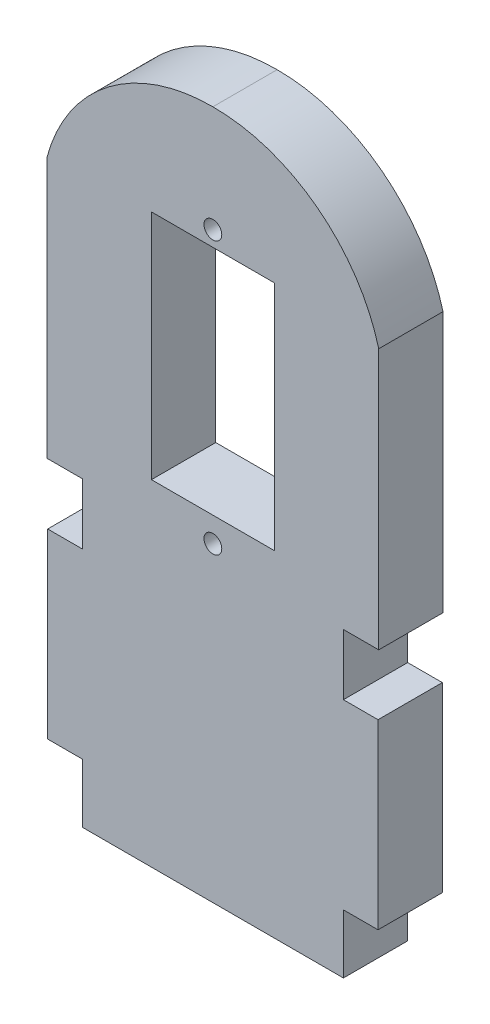
ISO-10303-21;
HEADER;
FILE_DESCRIPTION(('STEP AP214'),'2;1');
FILE_NAME('part.step','',(''),(''),'','','');
FILE_SCHEMA(('AUTOMOTIVE_DESIGN { 1 0 10303 214 1 1 1 1 }'));
ENDSEC;
DATA;
#1=APPLICATION_CONTEXT('core data for automotive mechanical design processes');
#2=APPLICATION_PROTOCOL_DEFINITION('international standard','automotive_design',2000,#1);
#3=PRODUCT_CONTEXT('',#1,'mechanical');
#4=PRODUCT('Part','Part','',(#3));
#5=PRODUCT_RELATED_PRODUCT_CATEGORY('part','',(#4));
#6=PRODUCT_DEFINITION_FORMATION('','',#4);
#7=PRODUCT_DEFINITION_CONTEXT('part definition',#1,'design');
#8=PRODUCT_DEFINITION('design','',#6,#7);
#9=PRODUCT_DEFINITION_SHAPE('','',#8);
#10=(LENGTH_UNIT() NAMED_UNIT(*) SI_UNIT(.MILLI.,.METRE.));
#11=(NAMED_UNIT(*) PLANE_ANGLE_UNIT() SI_UNIT($,.RADIAN.));
#12=(NAMED_UNIT(*) SI_UNIT($,.STERADIAN.) SOLID_ANGLE_UNIT());
#13=UNCERTAINTY_MEASURE_WITH_UNIT(LENGTH_MEASURE(1.E-05),#10,'distance_accuracy_value','');
#14=(GEOMETRIC_REPRESENTATION_CONTEXT(3) GLOBAL_UNCERTAINTY_ASSIGNED_CONTEXT((#13)) GLOBAL_UNIT_ASSIGNED_CONTEXT((#10,
#11,#12)) REPRESENTATION_CONTEXT('',''));
#15=CARTESIAN_POINT('',(0.,0.,0.));
#16=DIRECTION('',(0.,0.,1.));
#17=DIRECTION('',(1.,0.,0.));
#18=AXIS2_PLACEMENT_3D('',#15,#16,#17);
#19=CARTESIAN_POINT('',(48.9892867650321,0.,6.5));
#20=DIRECTION('',(1.,0.,0.));
#21=DIRECTION('',(0.,1.,0.));
#22=AXIS2_PLACEMENT_3D('',#19,#20,#21);
#23=PLANE('',#22);
#24=DIRECTION('',(0.,-1.,0.));
#25=VECTOR('',#24,1.);
#26=CARTESIAN_POINT('',(48.9892867650321,0.,0.));
#27=LINE('',#26,#25);
#28=CARTESIAN_POINT('',(48.9892867650321,76.6618321268697,0.));
#29=VERTEX_POINT('',#28);
#30=CARTESIAN_POINT('',(48.9892867650321,53.2123013687647,0.));
#31=VERTEX_POINT('',#30);
#32=EDGE_CURVE('E286',#29,#31,#27,.T.);
#33=ORIENTED_EDGE('',*,*,#32,.T.);
#34=DIRECTION('',(0.,0.,-1.));
#35=VECTOR('',#34,1.);
#36=CARTESIAN_POINT('',(48.9892867650321,53.2123013687647,6.5));
#37=LINE('',#36,#35);
#38=CARTESIAN_POINT('',(48.9892867650321,53.2123013687647,6.5));
#39=VERTEX_POINT('',#38);
#40=EDGE_CURVE('E11',#39,#31,#37,.T.);
#41=ORIENTED_EDGE('',*,*,#40,.F.);
#42=DIRECTION('',(0.,-1.,0.));
#43=VECTOR('',#42,1.);
#44=CARTESIAN_POINT('',(48.9892867650321,0.,6.5));
#45=LINE('',#44,#43);
#46=CARTESIAN_POINT('',(48.9892867650321,76.6618321268697,6.5));
#47=VERTEX_POINT('',#46);
#48=EDGE_CURVE('E197',#47,#39,#45,.T.);
#49=ORIENTED_EDGE('',*,*,#48,.F.);
#50=DIRECTION('',(0.,0.,-1.));
#51=VECTOR('',#50,1.);
#52=CARTESIAN_POINT('',(48.9892867650321,76.6618321268697,6.5));
#53=LINE('',#52,#51);
#54=EDGE_CURVE('E298',#47,#29,#53,.T.);
#55=ORIENTED_EDGE('',*,*,#54,.T.);
#56=EDGE_LOOP('',(#33,#41,#49,#55));
#57=FACE_BOUND('',#56,.T.);
#58=ADVANCED_FACE('F41',(#57),#23,.F.);
#59=CARTESIAN_POINT('',(0.,53.2123013687647,6.5));
#60=DIRECTION('',(0.,-1.,0.));
#61=DIRECTION('',(0.,0.,-1.));
#62=AXIS2_PLACEMENT_3D('',#59,#60,#61);
#63=PLANE('',#62);
#64=DIRECTION('',(-1.,0.,0.));
#65=VECTOR('',#64,1.);
#66=CARTESIAN_POINT('',(0.,53.2123013687647,0.));
#67=LINE('',#66,#65);
#68=CARTESIAN_POINT('',(36.5722867650322,53.2123013687647,0.));
#69=VERTEX_POINT('',#68);
#70=EDGE_CURVE('E204',#31,#69,#67,.T.);
#71=ORIENTED_EDGE('',*,*,#70,.T.);
#72=DIRECTION('',(0.,0.,-1.));
#73=VECTOR('',#72,1.);
#74=CARTESIAN_POINT('',(36.5722867650322,53.2123013687647,6.5));
#75=LINE('',#74,#73);
#76=CARTESIAN_POINT('',(36.5722867650322,53.2123013687647,6.5));
#77=VERTEX_POINT('',#76);
#78=EDGE_CURVE('E52',#77,#69,#75,.T.);
#79=ORIENTED_EDGE('',*,*,#78,.F.);
#80=DIRECTION('',(-1.,0.,0.));
#81=VECTOR('',#80,1.);
#82=CARTESIAN_POINT('',(0.,53.2123013687647,6.5));
#83=LINE('',#82,#81);
#84=EDGE_CURVE('E191',#39,#77,#83,.T.);
#85=ORIENTED_EDGE('',*,*,#84,.F.);
#86=ORIENTED_EDGE('',*,*,#40,.T.);
#87=EDGE_LOOP('',(#71,#79,#85,#86));
#88=FACE_BOUND('',#87,.T.);
#89=ADVANCED_FACE('F203',(#88),#63,.F.);
#90=CARTESIAN_POINT('',(36.5722867650322,0.,6.5));
#91=DIRECTION('',(1.,0.,0.));
#92=DIRECTION('',(0.,1.,0.));
#93=AXIS2_PLACEMENT_3D('',#90,#91,#92);
#94=PLANE('',#93);
#95=DIRECTION('',(0.,-1.,0.));
#96=VECTOR('',#95,1.);
#97=CARTESIAN_POINT('',(36.5722867650322,0.,0.));
#98=LINE('',#97,#96);
#99=CARTESIAN_POINT('',(36.5722867650322,76.6618321268697,0.));
#100=VERTEX_POINT('',#99);
#101=EDGE_CURVE('E292',#100,#69,#98,.T.);
#102=ORIENTED_EDGE('',*,*,#101,.F.);
#103=DIRECTION('',(0.,0.,-1.));
#104=VECTOR('',#103,1.);
#105=CARTESIAN_POINT('',(36.5722867650322,76.6618321268697,6.5));
#106=LINE('',#105,#104);
#107=CARTESIAN_POINT('',(36.5722867650322,76.6618321268697,6.5));
#108=VERTEX_POINT('',#107);
#109=EDGE_CURVE('E128',#108,#100,#106,.T.);
#110=ORIENTED_EDGE('',*,*,#109,.F.);
#111=DIRECTION('',(0.,-1.,0.));
#112=VECTOR('',#111,1.);
#113=CARTESIAN_POINT('',(36.5722867650322,0.,6.5));
#114=LINE('',#113,#112);
#115=EDGE_CURVE('E195',#108,#77,#114,.T.);
#116=ORIENTED_EDGE('',*,*,#115,.T.);
#117=ORIENTED_EDGE('',*,*,#78,.T.);
#118=EDGE_LOOP('',(#102,#110,#116,#117));
#119=FACE_BOUND('',#118,.T.);
#120=ADVANCED_FACE('F210',(#119),#94,.T.);
#121=CARTESIAN_POINT('',(42.7022867650322,71.6819664362486,6.5));
#122=DIRECTION('',(0.,0.,-1.));
#123=DIRECTION('',(-1.,0.,0.));
#124=AXIS2_PLACEMENT_3D('',#121,#122,#123);
#125=CYLINDRICAL_SURFACE('',#124,17.2853094196799);
#126=CARTESIAN_POINT('',(42.7022867650322,71.6819664362486,0.));
#127=DIRECTION('',(0.,0.,1.));
#128=DIRECTION('',(1.,0.,0.));
#129=AXIS2_PLACEMENT_3D('',#126,#127,#128);
#130=CIRCLE('',#129,17.2853094196799);
#131=CARTESIAN_POINT('',(26.0087867650322,76.1662701150903,0.));
#132=VERTEX_POINT('',#131);
#133=CARTESIAN_POINT('',(42.7807867650322,88.9670976039335,0.));
#134=VERTEX_POINT('',#133);
#135=EDGE_CURVE('E218',#132,#134,#130,.F.);
#136=ORIENTED_EDGE('',*,*,#135,.F.);
#137=DIRECTION('',(0.,0.,-1.));
#138=VECTOR('',#137,1.);
#139=CARTESIAN_POINT('',(26.0087867650322,76.1662701150903,6.5));
#140=LINE('',#139,#138);
#141=CARTESIAN_POINT('',(26.0087867650322,76.1662701150903,6.5));
#142=VERTEX_POINT('',#141);
#143=EDGE_CURVE('E45',#142,#132,#140,.T.);
#144=ORIENTED_EDGE('',*,*,#143,.F.);
#145=CARTESIAN_POINT('',(42.7022867650322,71.6819664362486,6.5));
#146=DIRECTION('',(0.,0.,1.));
#147=DIRECTION('',(1.,0.,0.));
#148=AXIS2_PLACEMENT_3D('',#145,#146,#147);
#149=CIRCLE('',#148,17.2853094196799);
#150=CARTESIAN_POINT('',(42.7807867650322,88.9670976039335,6.5));
#151=VERTEX_POINT('',#150);
#152=EDGE_CURVE('E297',#142,#151,#149,.F.);
#153=ORIENTED_EDGE('',*,*,#152,.T.);
#154=DIRECTION('',(0.,0.,-1.));
#155=VECTOR('',#154,1.);
#156=CARTESIAN_POINT('',(42.7807867650322,88.9670976039335,6.5));
#157=LINE('',#156,#155);
#158=EDGE_CURVE('E214',#151,#134,#157,.T.);
#159=ORIENTED_EDGE('',*,*,#158,.T.);
#160=EDGE_LOOP('',(#136,#144,#153,#159));
#161=FACE_BOUND('',#160,.T.);
#162=ADVANCED_FACE('F43',(#161),#125,.T.);
#163=CARTESIAN_POINT('',(26.0087867650322,0.,6.5));
#164=DIRECTION('',(-1.,0.,0.));
#165=DIRECTION('',(0.,0.,1.));
#166=AXIS2_PLACEMENT_3D('',#163,#164,#165);
#167=PLANE('',#166);
#168=DIRECTION('',(0.,1.,0.));
#169=VECTOR('',#168,1.);
#170=CARTESIAN_POINT('',(26.0087867650322,0.,0.));
#171=LINE('',#170,#169);
#172=CARTESIAN_POINT('',(26.0087867650322,49.7998558337563,0.));
#173=VERTEX_POINT('',#172);
#174=EDGE_CURVE('E222',#173,#132,#171,.T.);
#175=ORIENTED_EDGE('',*,*,#174,.F.);
#176=DIRECTION('',(0.,0.,-1.));
#177=VECTOR('',#176,1.);
#178=CARTESIAN_POINT('',(26.0087867650322,49.7998558337563,6.5));
#179=LINE('',#178,#177);
#180=CARTESIAN_POINT('',(26.0087867650322,49.7998558337563,6.5));
#181=VERTEX_POINT('',#180);
#182=EDGE_CURVE('E354',#181,#173,#179,.T.);
#183=ORIENTED_EDGE('',*,*,#182,.F.);
#184=DIRECTION('',(0.,1.,0.));
#185=VECTOR('',#184,1.);
#186=CARTESIAN_POINT('',(26.0087867650322,0.,6.5));
#187=LINE('',#186,#185);
#188=EDGE_CURVE('E365',#181,#142,#187,.T.);
#189=ORIENTED_EDGE('',*,*,#188,.T.);
#190=ORIENTED_EDGE('',*,*,#143,.T.);
#191=EDGE_LOOP('',(#175,#183,#189,#190));
#192=FACE_BOUND('',#191,.T.);
#193=ADVANCED_FACE('F363',(#192),#167,.T.);
#194=CARTESIAN_POINT('',(0.,49.7998558337564,6.5));
#195=DIRECTION('',(0.,-1.,0.));
#196=DIRECTION('',(1.,0.,0.));
#197=AXIS2_PLACEMENT_3D('',#194,#195,#196);
#198=PLANE('',#197);
#199=DIRECTION('',(-1.,0.,0.));
#200=VECTOR('',#199,1.);
#201=CARTESIAN_POINT('',(0.,49.7998558337564,0.));
#202=LINE('',#201,#200);
#203=CARTESIAN_POINT('',(29.5807867650322,49.7998558337563,0.));
#204=VERTEX_POINT('',#203);
#205=EDGE_CURVE('E226',#204,#173,#202,.T.);
#206=ORIENTED_EDGE('',*,*,#205,.F.);
#207=DIRECTION('',(0.,0.,-1.));
#208=VECTOR('',#207,1.);
#209=CARTESIAN_POINT('',(29.5807867650322,49.7998558337563,6.5));
#210=LINE('',#209,#208);
#211=CARTESIAN_POINT('',(29.5807867650322,49.7998558337563,6.5));
#212=VERTEX_POINT('',#211);
#213=EDGE_CURVE('E352',#212,#204,#210,.T.);
#214=ORIENTED_EDGE('',*,*,#213,.F.);
#215=DIRECTION('',(-1.,0.,0.));
#216=VECTOR('',#215,1.);
#217=CARTESIAN_POINT('',(0.,49.7998558337564,6.5));
#218=LINE('',#217,#216);
#219=EDGE_CURVE('E374',#212,#181,#218,.T.);
#220=ORIENTED_EDGE('',*,*,#219,.T.);
#221=ORIENTED_EDGE('',*,*,#182,.T.);
#222=EDGE_LOOP('',(#206,#214,#220,#221));
#223=FACE_BOUND('',#222,.T.);
#224=ADVANCED_FACE('F372',(#223),#198,.T.);
#225=CARTESIAN_POINT('',(29.5807867650322,0.,6.5));
#226=DIRECTION('',(-1.,0.,0.));
#227=DIRECTION('',(0.,0.,1.));
#228=AXIS2_PLACEMENT_3D('',#225,#226,#227);
#229=PLANE('',#228);
#230=DIRECTION('',(0.,1.,0.));
#231=VECTOR('',#230,1.);
#232=CARTESIAN_POINT('',(29.5807867650322,0.,0.));
#233=LINE('',#232,#231);
#234=CARTESIAN_POINT('',(29.5807867650322,43.6498558337563,0.));
#235=VERTEX_POINT('',#234);
#236=EDGE_CURVE('E230',#235,#204,#233,.T.);
#237=ORIENTED_EDGE('',*,*,#236,.F.);
#238=DIRECTION('',(0.,0.,-1.));
#239=VECTOR('',#238,1.);
#240=CARTESIAN_POINT('',(29.5807867650322,43.6498558337563,6.5));
#241=LINE('',#240,#239);
#242=CARTESIAN_POINT('',(29.5807867650322,43.6498558337563,6.5));
#243=VERTEX_POINT('',#242);
#244=EDGE_CURVE('E349',#243,#235,#241,.T.);
#245=ORIENTED_EDGE('',*,*,#244,.F.);
#246=DIRECTION('',(0.,1.,0.));
#247=VECTOR('',#246,1.);
#248=CARTESIAN_POINT('',(29.5807867650322,0.,6.5));
#249=LINE('',#248,#247);
#250=EDGE_CURVE('E381',#243,#212,#249,.T.);
#251=ORIENTED_EDGE('',*,*,#250,.T.);
#252=ORIENTED_EDGE('',*,*,#213,.T.);
#253=EDGE_LOOP('',(#237,#245,#251,#252));
#254=FACE_BOUND('',#253,.T.);
#255=ADVANCED_FACE('F385',(#254),#229,.T.);
#256=CARTESIAN_POINT('',(0.,43.6498558337563,6.5));
#257=DIRECTION('',(0.,1.,0.));
#258=DIRECTION('',(0.,0.,1.));
#259=AXIS2_PLACEMENT_3D('',#256,#257,#258);
#260=PLANE('',#259);
#261=DIRECTION('',(1.,0.,0.));
#262=VECTOR('',#261,1.);
#263=CARTESIAN_POINT('',(0.,43.6498558337563,0.));
#264=LINE('',#263,#262);
#265=CARTESIAN_POINT('',(26.0807867650322,43.6498558337563,0.));
#266=VERTEX_POINT('',#265);
#267=EDGE_CURVE('E234',#266,#235,#264,.T.);
#268=ORIENTED_EDGE('',*,*,#267,.F.);
#269=DIRECTION('',(0.,0.,-1.));
#270=VECTOR('',#269,1.);
#271=CARTESIAN_POINT('',(26.0807867650322,43.6498558337563,6.5));
#272=LINE('',#271,#270);
#273=CARTESIAN_POINT('',(26.0807867650322,43.6498558337563,6.5));
#274=VERTEX_POINT('',#273);
#275=EDGE_CURVE('E346',#274,#266,#272,.T.);
#276=ORIENTED_EDGE('',*,*,#275,.F.);
#277=DIRECTION('',(1.,0.,0.));
#278=VECTOR('',#277,1.);
#279=CARTESIAN_POINT('',(0.,43.6498558337563,6.5));
#280=LINE('',#279,#278);
#281=EDGE_CURVE('E387',#274,#243,#280,.T.);
#282=ORIENTED_EDGE('',*,*,#281,.T.);
#283=ORIENTED_EDGE('',*,*,#244,.T.);
#284=EDGE_LOOP('',(#268,#276,#282,#283));
#285=FACE_BOUND('',#284,.T.);
#286=ADVANCED_FACE('F516',(#285),#260,.T.);
#287=CARTESIAN_POINT('',(26.0807867650322,0.,6.5));
#288=DIRECTION('',(-1.,0.,0.));
#289=DIRECTION('',(0.,0.,1.));
#290=AXIS2_PLACEMENT_3D('',#287,#288,#289);
#291=PLANE('',#290);
#292=DIRECTION('',(0.,1.,0.));
#293=VECTOR('',#292,1.);
#294=CARTESIAN_POINT('',(26.0807867650322,0.,0.));
#295=LINE('',#294,#293);
#296=CARTESIAN_POINT('',(26.0807867650322,25.2498558337563,0.));
#297=VERTEX_POINT('',#296);
#298=EDGE_CURVE('E238',#297,#266,#295,.T.);
#299=ORIENTED_EDGE('',*,*,#298,.F.);
#300=DIRECTION('',(0.,0.,-1.));
#301=VECTOR('',#300,1.);
#302=CARTESIAN_POINT('',(26.0807867650322,25.2498558337563,6.5));
#303=LINE('',#302,#301);
#304=CARTESIAN_POINT('',(26.0807867650322,25.2498558337563,6.5));
#305=VERTEX_POINT('',#304);
#306=EDGE_CURVE('E343',#305,#297,#303,.T.);
#307=ORIENTED_EDGE('',*,*,#306,.F.);
#308=DIRECTION('',(0.,1.,0.));
#309=VECTOR('',#308,1.);
#310=CARTESIAN_POINT('',(26.0807867650322,0.,6.5));
#311=LINE('',#310,#309);
#312=EDGE_CURVE('E390',#305,#274,#311,.T.);
#313=ORIENTED_EDGE('',*,*,#312,.T.);
#314=ORIENTED_EDGE('',*,*,#275,.T.);
#315=EDGE_LOOP('',(#299,#307,#313,#314));
#316=FACE_BOUND('',#315,.T.);
#317=ADVANCED_FACE('F512',(#316),#291,.T.);
#318=CARTESIAN_POINT('',(0.,25.2498558337563,6.5));
#319=DIRECTION('',(0.,-1.,0.));
#320=DIRECTION('',(0.,0.,-1.));
#321=AXIS2_PLACEMENT_3D('',#318,#319,#320);
#322=PLANE('',#321);
#323=DIRECTION('',(-1.,0.,0.));
#324=VECTOR('',#323,1.);
#325=CARTESIAN_POINT('',(0.,25.2498558337563,0.));
#326=LINE('',#325,#324);
#327=CARTESIAN_POINT('',(29.5807867650322,25.2498558337563,0.));
#328=VERTEX_POINT('',#327);
#329=EDGE_CURVE('E242',#328,#297,#326,.T.);
#330=ORIENTED_EDGE('',*,*,#329,.F.);
#331=DIRECTION('',(0.,0.,-1.));
#332=VECTOR('',#331,1.);
#333=CARTESIAN_POINT('',(29.5807867650322,25.2498558337563,6.5));
#334=LINE('',#333,#332);
#335=CARTESIAN_POINT('',(29.5807867650322,25.2498558337563,6.5));
#336=VERTEX_POINT('',#335);
#337=EDGE_CURVE('E340',#336,#328,#334,.T.);
#338=ORIENTED_EDGE('',*,*,#337,.F.);
#339=DIRECTION('',(-1.,0.,0.));
#340=VECTOR('',#339,1.);
#341=CARTESIAN_POINT('',(0.,25.2498558337563,6.5));
#342=LINE('',#341,#340);
#343=EDGE_CURVE('E397',#336,#305,#342,.T.);
#344=ORIENTED_EDGE('',*,*,#343,.T.);
#345=ORIENTED_EDGE('',*,*,#306,.T.);
#346=EDGE_LOOP('',(#330,#338,#344,#345));
#347=FACE_BOUND('',#346,.T.);
#348=ADVANCED_FACE('F508',(#347),#322,.T.);
#349=CARTESIAN_POINT('',(29.5807867650321,0.,6.5));
#350=DIRECTION('',(-1.,0.,0.));
#351=DIRECTION('',(0.,-1.,0.));
#352=AXIS2_PLACEMENT_3D('',#349,#350,#351);
#353=PLANE('',#352);
#354=DIRECTION('',(0.,1.,0.));
#355=VECTOR('',#354,1.);
#356=CARTESIAN_POINT('',(29.5807867650321,0.,0.));
#357=LINE('',#356,#355);
#358=CARTESIAN_POINT('',(29.5807867650321,19.2798558337563,0.));
#359=VERTEX_POINT('',#358);
#360=EDGE_CURVE('E246',#359,#328,#357,.T.);
#361=ORIENTED_EDGE('',*,*,#360,.F.);
#362=DIRECTION('',(0.,0.,-1.));
#363=VECTOR('',#362,1.);
#364=CARTESIAN_POINT('',(29.5807867650321,19.2798558337563,6.5));
#365=LINE('',#364,#363);
#366=CARTESIAN_POINT('',(29.5807867650321,19.2798558337563,6.5));
#367=VERTEX_POINT('',#366);
#368=EDGE_CURVE('E337',#367,#359,#365,.T.);
#369=ORIENTED_EDGE('',*,*,#368,.F.);
#370=DIRECTION('',(0.,1.,0.));
#371=VECTOR('',#370,1.);
#372=CARTESIAN_POINT('',(29.5807867650321,0.,6.5));
#373=LINE('',#372,#371);
#374=EDGE_CURVE('E401',#367,#336,#373,.T.);
#375=ORIENTED_EDGE('',*,*,#374,.T.);
#376=ORIENTED_EDGE('',*,*,#337,.T.);
#377=EDGE_LOOP('',(#361,#369,#375,#376));
#378=FACE_BOUND('',#377,.T.);
#379=ADVANCED_FACE('F504',(#378),#353,.T.);
#380=CARTESIAN_POINT('',(0.,19.2798558337563,6.5));
#381=DIRECTION('',(0.,1.,0.));
#382=DIRECTION('',(-1.,0.,0.));
#383=AXIS2_PLACEMENT_3D('',#380,#381,#382);
#384=PLANE('',#383);
#385=DIRECTION('',(1.,0.,0.));
#386=VECTOR('',#385,1.);
#387=CARTESIAN_POINT('',(0.,19.2798558337563,0.));
#388=LINE('',#387,#386);
#389=CARTESIAN_POINT('',(55.9807867650322,19.2798558337563,0.));
#390=VERTEX_POINT('',#389);
#391=EDGE_CURVE('E250',#359,#390,#388,.T.);
#392=ORIENTED_EDGE('',*,*,#391,.T.);
#393=DIRECTION('',(0.,0.,-1.));
#394=VECTOR('',#393,1.);
#395=CARTESIAN_POINT('',(55.9807867650322,19.2798558337563,6.5));
#396=LINE('',#395,#394);
#397=CARTESIAN_POINT('',(55.9807867650322,19.2798558337563,6.5));
#398=VERTEX_POINT('',#397);
#399=EDGE_CURVE('E333',#398,#390,#396,.T.);
#400=ORIENTED_EDGE('',*,*,#399,.F.);
#401=DIRECTION('',(1.,0.,0.));
#402=VECTOR('',#401,1.);
#403=CARTESIAN_POINT('',(0.,19.2798558337563,6.5));
#404=LINE('',#403,#402);
#405=EDGE_CURVE('E405',#367,#398,#404,.T.);
#406=ORIENTED_EDGE('',*,*,#405,.F.);
#407=ORIENTED_EDGE('',*,*,#368,.T.);
#408=EDGE_LOOP('',(#392,#400,#406,#407));
#409=FACE_BOUND('',#408,.T.);
#410=ADVANCED_FACE('F500',(#409),#384,.F.);
#411=CARTESIAN_POINT('',(55.9807867650322,0.,6.5));
#412=DIRECTION('',(-1.,0.,0.));
#413=DIRECTION('',(0.,0.,1.));
#414=AXIS2_PLACEMENT_3D('',#411,#412,#413);
#415=PLANE('',#414);
#416=DIRECTION('',(0.,1.,0.));
#417=VECTOR('',#416,1.);
#418=CARTESIAN_POINT('',(55.9807867650322,0.,0.));
#419=LINE('',#418,#417);
#420=CARTESIAN_POINT('',(55.9807867650322,25.2498558337563,0.));
#421=VERTEX_POINT('',#420);
#422=EDGE_CURVE('E253',#390,#421,#419,.T.);
#423=ORIENTED_EDGE('',*,*,#422,.T.);
#424=DIRECTION('',(0.,0.,-1.));
#425=VECTOR('',#424,1.);
#426=CARTESIAN_POINT('',(55.9807867650322,25.2498558337563,6.5));
#427=LINE('',#426,#425);
#428=CARTESIAN_POINT('',(55.9807867650322,25.2498558337563,6.5));
#429=VERTEX_POINT('',#428);
#430=EDGE_CURVE('E329',#429,#421,#427,.T.);
#431=ORIENTED_EDGE('',*,*,#430,.F.);
#432=DIRECTION('',(0.,1.,0.));
#433=VECTOR('',#432,1.);
#434=CARTESIAN_POINT('',(55.9807867650322,0.,6.5));
#435=LINE('',#434,#433);
#436=EDGE_CURVE('E408',#398,#429,#435,.T.);
#437=ORIENTED_EDGE('',*,*,#436,.F.);
#438=ORIENTED_EDGE('',*,*,#399,.T.);
#439=EDGE_LOOP('',(#423,#431,#437,#438));
#440=FACE_BOUND('',#439,.T.);
#441=ADVANCED_FACE('F496',(#440),#415,.F.);
#442=CARTESIAN_POINT('',(0.,25.2498558337563,6.5));
#443=DIRECTION('',(0.,1.,0.));
#444=DIRECTION('',(0.,0.,1.));
#445=AXIS2_PLACEMENT_3D('',#442,#443,#444);
#446=PLANE('',#445);
#447=DIRECTION('',(1.,0.,0.));
#448=VECTOR('',#447,1.);
#449=CARTESIAN_POINT('',(0.,25.2498558337563,0.));
#450=LINE('',#449,#448);
#451=CARTESIAN_POINT('',(59.4807867650322,25.2498558337563,0.));
#452=VERTEX_POINT('',#451);
#453=EDGE_CURVE('E256',#421,#452,#450,.T.);
#454=ORIENTED_EDGE('',*,*,#453,.T.);
#455=DIRECTION('',(0.,0.,-1.));
#456=VECTOR('',#455,1.);
#457=CARTESIAN_POINT('',(59.4807867650322,25.2498558337563,6.5));
#458=LINE('',#457,#456);
#459=CARTESIAN_POINT('',(59.4807867650322,25.2498558337563,6.5));
#460=VERTEX_POINT('',#459);
#461=EDGE_CURVE('E325',#460,#452,#458,.T.);
#462=ORIENTED_EDGE('',*,*,#461,.F.);
#463=DIRECTION('',(1.,0.,0.));
#464=VECTOR('',#463,1.);
#465=CARTESIAN_POINT('',(0.,25.2498558337563,6.5));
#466=LINE('',#465,#464);
#467=EDGE_CURVE('E411',#429,#460,#466,.T.);
#468=ORIENTED_EDGE('',*,*,#467,.F.);
#469=ORIENTED_EDGE('',*,*,#430,.T.);
#470=EDGE_LOOP('',(#454,#462,#468,#469));
#471=FACE_BOUND('',#470,.T.);
#472=ADVANCED_FACE('F492',(#471),#446,.F.);
#473=CARTESIAN_POINT('',(59.4807867650322,0.,6.5));
#474=DIRECTION('',(-1.,0.,0.));
#475=DIRECTION('',(0.,0.,1.));
#476=AXIS2_PLACEMENT_3D('',#473,#474,#475);
#477=PLANE('',#476);
#478=DIRECTION('',(0.,1.,0.));
#479=VECTOR('',#478,1.);
#480=CARTESIAN_POINT('',(59.4807867650322,0.,0.));
#481=LINE('',#480,#479);
#482=CARTESIAN_POINT('',(59.4807867650322,43.6498558337563,0.));
#483=VERTEX_POINT('',#482);
#484=EDGE_CURVE('E259',#452,#483,#481,.T.);
#485=ORIENTED_EDGE('',*,*,#484,.T.);
#486=DIRECTION('',(0.,0.,-1.));
#487=VECTOR('',#486,1.);
#488=CARTESIAN_POINT('',(59.4807867650322,43.6498558337563,6.5));
#489=LINE('',#488,#487);
#490=CARTESIAN_POINT('',(59.4807867650322,43.6498558337563,6.5));
#491=VERTEX_POINT('',#490);
#492=EDGE_CURVE('E321',#491,#483,#489,.T.);
#493=ORIENTED_EDGE('',*,*,#492,.F.);
#494=DIRECTION('',(0.,1.,0.));
#495=VECTOR('',#494,1.);
#496=CARTESIAN_POINT('',(59.4807867650322,0.,6.5));
#497=LINE('',#496,#495);
#498=EDGE_CURVE('E414',#460,#491,#497,.T.);
#499=ORIENTED_EDGE('',*,*,#498,.F.);
#500=ORIENTED_EDGE('',*,*,#461,.T.);
#501=EDGE_LOOP('',(#485,#493,#499,#500));
#502=FACE_BOUND('',#501,.T.);
#503=ADVANCED_FACE('F488',(#502),#477,.F.);
#504=CARTESIAN_POINT('',(0.,43.6498558337563,6.5));
#505=DIRECTION('',(0.,-1.,0.));
#506=DIRECTION('',(0.,0.,-1.));
#507=AXIS2_PLACEMENT_3D('',#504,#505,#506);
#508=PLANE('',#507);
#509=DIRECTION('',(-1.,0.,0.));
#510=VECTOR('',#509,1.);
#511=CARTESIAN_POINT('',(0.,43.6498558337563,0.));
#512=LINE('',#511,#510);
#513=CARTESIAN_POINT('',(55.9807867650322,43.6498558337563,0.));
#514=VERTEX_POINT('',#513);
#515=EDGE_CURVE('E262',#483,#514,#512,.T.);
#516=ORIENTED_EDGE('',*,*,#515,.T.);
#517=DIRECTION('',(0.,0.,-1.));
#518=VECTOR('',#517,1.);
#519=CARTESIAN_POINT('',(55.9807867650322,43.6498558337563,6.5));
#520=LINE('',#519,#518);
#521=CARTESIAN_POINT('',(55.9807867650322,43.6498558337563,6.5));
#522=VERTEX_POINT('',#521);
#523=EDGE_CURVE('E317',#522,#514,#520,.T.);
#524=ORIENTED_EDGE('',*,*,#523,.F.);
#525=DIRECTION('',(-1.,0.,0.));
#526=VECTOR('',#525,1.);
#527=CARTESIAN_POINT('',(0.,43.6498558337563,6.5));
#528=LINE('',#527,#526);
#529=EDGE_CURVE('E417',#491,#522,#528,.T.);
#530=ORIENTED_EDGE('',*,*,#529,.F.);
#531=ORIENTED_EDGE('',*,*,#492,.T.);
#532=EDGE_LOOP('',(#516,#524,#530,#531));
#533=FACE_BOUND('',#532,.T.);
#534=ADVANCED_FACE('F484',(#533),#508,.F.);
#535=CARTESIAN_POINT('',(55.9807867650322,0.,6.5));
#536=DIRECTION('',(-1.,0.,0.));
#537=DIRECTION('',(0.,0.,1.));
#538=AXIS2_PLACEMENT_3D('',#535,#536,#537);
#539=PLANE('',#538);
#540=DIRECTION('',(0.,1.,0.));
#541=VECTOR('',#540,1.);
#542=CARTESIAN_POINT('',(55.9807867650322,0.,0.));
#543=LINE('',#542,#541);
#544=CARTESIAN_POINT('',(55.9807867650322,49.7998558337563,0.));
#545=VERTEX_POINT('',#544);
#546=EDGE_CURVE('E265',#514,#545,#543,.T.);
#547=ORIENTED_EDGE('',*,*,#546,.T.);
#548=DIRECTION('',(0.,0.,-1.));
#549=VECTOR('',#548,1.);
#550=CARTESIAN_POINT('',(55.9807867650322,49.7998558337563,6.5));
#551=LINE('',#550,#549);
#552=CARTESIAN_POINT('',(55.9807867650322,49.7998558337563,6.5));
#553=VERTEX_POINT('',#552);
#554=EDGE_CURVE('E313',#553,#545,#551,.T.);
#555=ORIENTED_EDGE('',*,*,#554,.F.);
#556=DIRECTION('',(0.,1.,0.));
#557=VECTOR('',#556,1.);
#558=CARTESIAN_POINT('',(55.9807867650322,0.,6.5));
#559=LINE('',#558,#557);
#560=EDGE_CURVE('E420',#522,#553,#559,.T.);
#561=ORIENTED_EDGE('',*,*,#560,.F.);
#562=ORIENTED_EDGE('',*,*,#523,.T.);
#563=EDGE_LOOP('',(#547,#555,#561,#562));
#564=FACE_BOUND('',#563,.T.);
#565=ADVANCED_FACE('F480',(#564),#539,.F.);
#566=CARTESIAN_POINT('',(0.,49.7998558337562,6.5));
#567=DIRECTION('',(0.,1.,0.));
#568=DIRECTION('',(-1.,0.,0.));
#569=AXIS2_PLACEMENT_3D('',#566,#567,#568);
#570=PLANE('',#569);
#571=DIRECTION('',(1.,0.,0.));
#572=VECTOR('',#571,1.);
#573=CARTESIAN_POINT('',(0.,49.7998558337562,0.));
#574=LINE('',#573,#572);
#575=CARTESIAN_POINT('',(59.5527867650321,49.7998558337563,0.));
#576=VERTEX_POINT('',#575);
#577=EDGE_CURVE('E268',#545,#576,#574,.T.);
#578=ORIENTED_EDGE('',*,*,#577,.T.);
#579=DIRECTION('',(0.,0.,-1.));
#580=VECTOR('',#579,1.);
#581=CARTESIAN_POINT('',(59.5527867650321,49.7998558337563,6.5));
#582=LINE('',#581,#580);
#583=CARTESIAN_POINT('',(59.5527867650321,49.7998558337563,6.5));
#584=VERTEX_POINT('',#583);
#585=EDGE_CURVE('E309',#584,#576,#582,.T.);
#586=ORIENTED_EDGE('',*,*,#585,.F.);
#587=DIRECTION('',(1.,0.,0.));
#588=VECTOR('',#587,1.);
#589=CARTESIAN_POINT('',(0.,49.7998558337562,6.5));
#590=LINE('',#589,#588);
#591=EDGE_CURVE('E423',#553,#584,#590,.T.);
#592=ORIENTED_EDGE('',*,*,#591,.F.);
#593=ORIENTED_EDGE('',*,*,#554,.T.);
#594=EDGE_LOOP('',(#578,#586,#592,#593));
#595=FACE_BOUND('',#594,.T.);
#596=ADVANCED_FACE('F476',(#595),#570,.F.);
#597=CARTESIAN_POINT('',(59.5527867650321,0.,6.5));
#598=DIRECTION('',(-1.,0.,0.));
#599=DIRECTION('',(0.,0.,1.));
#600=AXIS2_PLACEMENT_3D('',#597,#598,#599);
#601=PLANE('',#600);
#602=DIRECTION('',(0.,1.,0.));
#603=VECTOR('',#602,1.);
#604=CARTESIAN_POINT('',(59.5527867650321,0.,0.));
#605=LINE('',#604,#603);
#606=CARTESIAN_POINT('',(59.5527867650321,76.1662701150903,0.));
#607=VERTEX_POINT('',#606);
#608=EDGE_CURVE('E271',#576,#607,#605,.T.);
#609=ORIENTED_EDGE('',*,*,#608,.T.);
#610=DIRECTION('',(0.,0.,-1.));
#611=VECTOR('',#610,1.);
#612=CARTESIAN_POINT('',(59.5527867650321,76.1662701150903,6.5));
#613=LINE('',#612,#611);
#614=CARTESIAN_POINT('',(59.5527867650321,76.1662701150903,6.5));
#615=VERTEX_POINT('',#614);
#616=EDGE_CURVE('E305',#615,#607,#613,.T.);
#617=ORIENTED_EDGE('',*,*,#616,.F.);
#618=DIRECTION('',(0.,1.,0.));
#619=VECTOR('',#618,1.);
#620=CARTESIAN_POINT('',(59.5527867650321,0.,6.5));
#621=LINE('',#620,#619);
#622=EDGE_CURVE('E426',#584,#615,#621,.T.);
#623=ORIENTED_EDGE('',*,*,#622,.F.);
#624=ORIENTED_EDGE('',*,*,#585,.T.);
#625=EDGE_LOOP('',(#609,#617,#623,#624));
#626=FACE_BOUND('',#625,.T.);
#627=ADVANCED_FACE('F467',(#626),#601,.F.);
#628=CARTESIAN_POINT('',(42.7807867650322,50.7123013687647,6.5));
#629=DIRECTION('',(0.,0.,-1.));
#630=DIRECTION('',(-1.,0.,0.));
#631=AXIS2_PLACEMENT_3D('',#628,#629,#630);
#632=CYLINDRICAL_SURFACE('',#631,0.899999999999996);
#633=CARTESIAN_POINT('',(42.7807867650322,50.7123013687647,6.5));
#634=DIRECTION('',(0.,0.,1.));
#635=DIRECTION('',(1.,0.,0.));
#636=AXIS2_PLACEMENT_3D('',#633,#634,#635);
#637=CIRCLE('',#636,0.899999999999996);
#638=CARTESIAN_POINT('',(43.6807867650322,50.7123013687647,6.5));
#639=VERTEX_POINT('',#638);
#640=EDGE_CURVE('E436',#639,#639,#637,.T.);
#641=ORIENTED_EDGE('',*,*,#640,.T.);
#642=EDGE_LOOP('',(#641));
#643=FACE_BOUND('',#642,.T.);
#644=CARTESIAN_POINT('',(42.7807867650322,50.7123013687647,0.));
#645=DIRECTION('',(0.,0.,1.));
#646=DIRECTION('',(1.,0.,0.));
#647=AXIS2_PLACEMENT_3D('',#644,#645,#646);
#648=CIRCLE('',#647,0.899999999999996);
#649=CARTESIAN_POINT('',(43.6807867650322,50.7123013687647,0.));
#650=VERTEX_POINT('',#649);
#651=EDGE_CURVE('E282',#650,#650,#648,.T.);
#652=ORIENTED_EDGE('',*,*,#651,.F.);
#653=EDGE_LOOP('',(#652));
#654=FACE_BOUND('',#653,.T.);
#655=ADVANCED_FACE('F442',(#643,#654),#632,.F.);
#656=CARTESIAN_POINT('',(42.7807867650322,78.2123013687647,6.5));
#657=DIRECTION('',(0.,0.,-1.));
#658=DIRECTION('',(-1.,0.,0.));
#659=AXIS2_PLACEMENT_3D('',#656,#657,#658);
#660=CYLINDRICAL_SURFACE('',#659,0.899999999999996);
#661=CARTESIAN_POINT('',(42.7807867650322,78.2123013687647,6.5));
#662=DIRECTION('',(0.,0.,1.));
#663=DIRECTION('',(1.,0.,0.));
#664=AXIS2_PLACEMENT_3D('',#661,#662,#663);
#665=CIRCLE('',#664,0.899999999999996);
#666=CARTESIAN_POINT('',(43.6807867650322,78.2123013687647,6.5));
#667=VERTEX_POINT('',#666);
#668=EDGE_CURVE('E432',#667,#667,#665,.T.);
#669=ORIENTED_EDGE('',*,*,#668,.T.);
#670=EDGE_LOOP('',(#669));
#671=FACE_BOUND('',#670,.T.);
#672=CARTESIAN_POINT('',(42.7807867650322,78.2123013687647,0.));
#673=DIRECTION('',(0.,0.,1.));
#674=DIRECTION('',(1.,0.,0.));
#675=AXIS2_PLACEMENT_3D('',#672,#673,#674);
#676=CIRCLE('',#675,0.899999999999996);
#677=CARTESIAN_POINT('',(43.6807867650322,78.2123013687647,0.));
#678=VERTEX_POINT('',#677);
#679=EDGE_CURVE('E278',#678,#678,#676,.T.);
#680=ORIENTED_EDGE('',*,*,#679,.F.);
#681=EDGE_LOOP('',(#680));
#682=FACE_BOUND('',#681,.T.);
#683=ADVANCED_FACE('F466',(#671,#682),#660,.F.);
#684=CARTESIAN_POINT('',(42.8592867650321,71.6819664362486,6.5));
#685=DIRECTION('',(0.,0.,-1.));
#686=DIRECTION('',(-1.,0.,0.));
#687=AXIS2_PLACEMENT_3D('',#684,#685,#686);
#688=CYLINDRICAL_SURFACE('',#687,17.2853094196799);
#689=CARTESIAN_POINT('',(42.8592867650321,71.6819664362486,0.));
#690=DIRECTION('',(0.,0.,1.));
#691=DIRECTION('',(1.,0.,0.));
#692=AXIS2_PLACEMENT_3D('',#689,#690,#691);
#693=CIRCLE('',#692,17.2853094196799);
#694=EDGE_CURVE('E274',#607,#134,#693,.T.);
#695=ORIENTED_EDGE('',*,*,#694,.T.);
#696=ORIENTED_EDGE('',*,*,#158,.F.);
#697=CARTESIAN_POINT('',(42.8592867650321,71.6819664362486,6.5));
#698=DIRECTION('',(0.,0.,1.));
#699=DIRECTION('',(1.,0.,0.));
#700=AXIS2_PLACEMENT_3D('',#697,#698,#699);
#701=CIRCLE('',#700,17.2853094196799);
#702=EDGE_CURVE('E429',#615,#151,#701,.T.);
#703=ORIENTED_EDGE('',*,*,#702,.F.);
#704=ORIENTED_EDGE('',*,*,#616,.T.);
#705=EDGE_LOOP('',(#695,#696,#703,#704));
#706=FACE_BOUND('',#705,.T.);
#707=ADVANCED_FACE('F453',(#706),#688,.T.);
#708=CARTESIAN_POINT('',(0.,76.6618321268697,6.5));
#709=DIRECTION('',(0.,1.,0.));
#710=DIRECTION('',(0.,0.,1.));
#711=AXIS2_PLACEMENT_3D('',#708,#709,#710);
#712=PLANE('',#711);
#713=DIRECTION('',(1.,0.,0.));
#714=VECTOR('',#713,1.);
#715=CARTESIAN_POINT('',(0.,76.6618321268697,0.));
#716=LINE('',#715,#714);
#717=EDGE_CURVE('E131',#100,#29,#716,.T.);
#718=ORIENTED_EDGE('',*,*,#717,.T.);
#719=ORIENTED_EDGE('',*,*,#54,.F.);
#720=DIRECTION('',(1.,0.,0.));
#721=VECTOR('',#720,1.);
#722=CARTESIAN_POINT('',(0.,76.6618321268697,6.5));
#723=LINE('',#722,#721);
#724=EDGE_CURVE('E61',#108,#47,#723,.T.);
#725=ORIENTED_EDGE('',*,*,#724,.F.);
#726=ORIENTED_EDGE('',*,*,#109,.T.);
#727=EDGE_LOOP('',(#718,#719,#725,#726));
#728=FACE_BOUND('',#727,.T.);
#729=ADVANCED_FACE('F446',(#728),#712,.F.);
#730=CARTESIAN_POINT('',(0.,0.,6.5));
#731=DIRECTION('',(0.,0.,1.));
#732=DIRECTION('',(1.,0.,0.));
#733=AXIS2_PLACEMENT_3D('',#730,#731,#732);
#734=PLANE('',#733);
#735=ORIENTED_EDGE('',*,*,#152,.F.);
#736=ORIENTED_EDGE('',*,*,#188,.F.);
#737=ORIENTED_EDGE('',*,*,#219,.F.);
#738=ORIENTED_EDGE('',*,*,#250,.F.);
#739=ORIENTED_EDGE('',*,*,#281,.F.);
#740=ORIENTED_EDGE('',*,*,#312,.F.);
#741=ORIENTED_EDGE('',*,*,#343,.F.);
#742=ORIENTED_EDGE('',*,*,#374,.F.);
#743=ORIENTED_EDGE('',*,*,#405,.T.);
#744=ORIENTED_EDGE('',*,*,#436,.T.);
#745=ORIENTED_EDGE('',*,*,#467,.T.);
#746=ORIENTED_EDGE('',*,*,#498,.T.);
#747=ORIENTED_EDGE('',*,*,#529,.T.);
#748=ORIENTED_EDGE('',*,*,#560,.T.);
#749=ORIENTED_EDGE('',*,*,#591,.T.);
#750=ORIENTED_EDGE('',*,*,#622,.T.);
#751=ORIENTED_EDGE('',*,*,#702,.T.);
#752=EDGE_LOOP('',(#735,#736,#737,#738,#739,#740,#741,#742,#743,#744,#745,#746,#747,#748,#749,
#750,#751));
#753=FACE_BOUND('',#752,.T.);
#754=ORIENTED_EDGE('',*,*,#668,.F.);
#755=EDGE_LOOP('',(#754));
#756=FACE_BOUND('',#755,.T.);
#757=ORIENTED_EDGE('',*,*,#640,.F.);
#758=EDGE_LOOP('',(#757));
#759=FACE_BOUND('',#758,.T.);
#760=ORIENTED_EDGE('',*,*,#48,.T.);
#761=ORIENTED_EDGE('',*,*,#84,.T.);
#762=ORIENTED_EDGE('',*,*,#115,.F.);
#763=ORIENTED_EDGE('',*,*,#724,.T.);
#764=EDGE_LOOP('',(#760,#761,#762,#763));
#765=FACE_BOUND('',#764,.T.);
#766=ADVANCED_FACE('F193',(#753,#756,#759,#765),#734,.T.);
#767=CARTESIAN_POINT('',(0.,0.,0.));
#768=DIRECTION('',(0.,0.,1.));
#769=DIRECTION('',(1.,0.,0.));
#770=AXIS2_PLACEMENT_3D('',#767,#768,#769);
#771=PLANE('',#770);
#772=ORIENTED_EDGE('',*,*,#135,.T.);
#773=ORIENTED_EDGE('',*,*,#694,.F.);
#774=ORIENTED_EDGE('',*,*,#608,.F.);
#775=ORIENTED_EDGE('',*,*,#577,.F.);
#776=ORIENTED_EDGE('',*,*,#546,.F.);
#777=ORIENTED_EDGE('',*,*,#515,.F.);
#778=ORIENTED_EDGE('',*,*,#484,.F.);
#779=ORIENTED_EDGE('',*,*,#453,.F.);
#780=ORIENTED_EDGE('',*,*,#422,.F.);
#781=ORIENTED_EDGE('',*,*,#391,.F.);
#782=ORIENTED_EDGE('',*,*,#360,.T.);
#783=ORIENTED_EDGE('',*,*,#329,.T.);
#784=ORIENTED_EDGE('',*,*,#298,.T.);
#785=ORIENTED_EDGE('',*,*,#267,.T.);
#786=ORIENTED_EDGE('',*,*,#236,.T.);
#787=ORIENTED_EDGE('',*,*,#205,.T.);
#788=ORIENTED_EDGE('',*,*,#174,.T.);
#789=EDGE_LOOP('',(#772,#773,#774,#775,#776,#777,#778,#779,#780,#781,#782,#783,#784,#785,#786,
#787,#788));
#790=FACE_BOUND('',#789,.T.);
#791=ORIENTED_EDGE('',*,*,#679,.T.);
#792=EDGE_LOOP('',(#791));
#793=FACE_BOUND('',#792,.T.);
#794=ORIENTED_EDGE('',*,*,#651,.T.);
#795=EDGE_LOOP('',(#794));
#796=FACE_BOUND('',#795,.T.);
#797=ORIENTED_EDGE('',*,*,#32,.F.);
#798=ORIENTED_EDGE('',*,*,#717,.F.);
#799=ORIENTED_EDGE('',*,*,#101,.T.);
#800=ORIENTED_EDGE('',*,*,#70,.F.);
#801=EDGE_LOOP('',(#797,#798,#799,#800));
#802=FACE_BOUND('',#801,.T.);
#803=ADVANCED_FACE('F369',(#790,#793,#796,#802),#771,.F.);
#804=CLOSED_SHELL('',(#58,#89,#120,#162,#193,#224,#255,#286,#317,#348,#379,#410,#441,#472,#503,
#534,#565,#596,#627,#655,#683,#707,#729,#766,#803));
#805=MANIFOLD_SOLID_BREP('B2',#804);
#806=ADVANCED_BREP_SHAPE_REPRESENTATION('',(#18,#805),#14);
#807=SHAPE_DEFINITION_REPRESENTATION(#9,#806);
ENDSEC;
END-ISO-10303-21;
